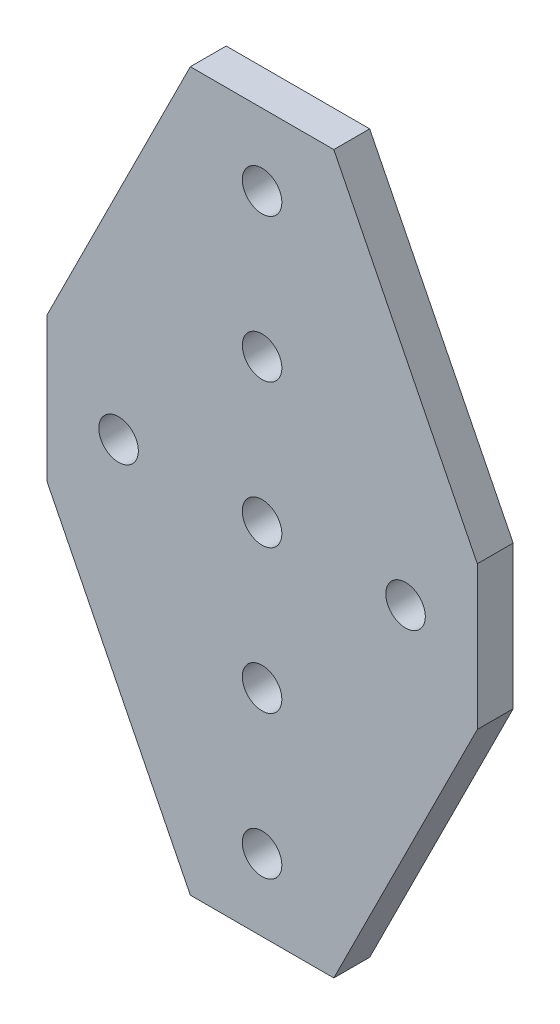
ISO-10303-21;
HEADER;
FILE_DESCRIPTION(('STEP AP214'),'2;1');
FILE_NAME('part.step','',(''),(''),'','','');
FILE_SCHEMA(('AUTOMOTIVE_DESIGN { 1 0 10303 214 1 1 1 1 }'));
ENDSEC;
DATA;
#1=APPLICATION_CONTEXT('core data for automotive mechanical design processes');
#2=APPLICATION_PROTOCOL_DEFINITION('international standard','automotive_design',2000,#1);
#3=PRODUCT_CONTEXT('',#1,'mechanical');
#4=PRODUCT('Part','Part','',(#3));
#5=PRODUCT_RELATED_PRODUCT_CATEGORY('part','',(#4));
#6=PRODUCT_DEFINITION_FORMATION('','',#4);
#7=PRODUCT_DEFINITION_CONTEXT('part definition',#1,'design');
#8=PRODUCT_DEFINITION('design','',#6,#7);
#9=PRODUCT_DEFINITION_SHAPE('','',#8);
#10=(LENGTH_UNIT() NAMED_UNIT(*) SI_UNIT(.MILLI.,.METRE.));
#11=(NAMED_UNIT(*) PLANE_ANGLE_UNIT() SI_UNIT($,.RADIAN.));
#12=(NAMED_UNIT(*) SI_UNIT($,.STERADIAN.) SOLID_ANGLE_UNIT());
#13=UNCERTAINTY_MEASURE_WITH_UNIT(LENGTH_MEASURE(1.E-05),#10,'distance_accuracy_value','');
#14=(GEOMETRIC_REPRESENTATION_CONTEXT(3) GLOBAL_UNCERTAINTY_ASSIGNED_CONTEXT((#13)) GLOBAL_UNIT_ASSIGNED_CONTEXT((#10,
#11,#12)) REPRESENTATION_CONTEXT('',''));
#15=CARTESIAN_POINT('',(0.,0.,0.));
#16=DIRECTION('',(0.,0.,1.));
#17=DIRECTION('',(1.,0.,0.));
#18=AXIS2_PLACEMENT_3D('',#15,#16,#17);
#19=CARTESIAN_POINT('',(0.,0.,6.35));
#20=DIRECTION('',(0.894427190999916,0.447213595499958,0.));
#21=DIRECTION('',(-0.447213595499958,0.894427190999916,0.));
#22=AXIS2_PLACEMENT_3D('',#19,#20,#21);
#23=PLANE('',#22);
#24=DIRECTION('',(0.447213595499958,-0.894427190999916,0.));
#25=VECTOR('',#24,1.);
#26=CARTESIAN_POINT('',(0.,0.,0.));
#27=LINE('',#26,#25);
#28=CARTESIAN_POINT('',(-25.4,50.8,0.));
#29=VERTEX_POINT('',#28);
#30=CARTESIAN_POINT('',(0.,0.,0.));
#31=VERTEX_POINT('',#30);
#32=EDGE_CURVE('E132',#29,#31,#27,.T.);
#33=ORIENTED_EDGE('',*,*,#32,.T.);
#34=DIRECTION('',(0.,0.,-1.));
#35=VECTOR('',#34,1.);
#36=CARTESIAN_POINT('',(0.,0.,6.35));
#37=LINE('',#36,#35);
#38=CARTESIAN_POINT('',(0.,0.,6.35));
#39=VERTEX_POINT('',#38);
#40=EDGE_CURVE('E11',#39,#31,#37,.T.);
#41=ORIENTED_EDGE('',*,*,#40,.F.);
#42=DIRECTION('',(0.447213595499958,-0.894427190999916,0.));
#43=VECTOR('',#42,1.);
#44=CARTESIAN_POINT('',(0.,0.,6.35));
#45=LINE('',#44,#43);
#46=CARTESIAN_POINT('',(-25.4,50.8,6.35));
#47=VERTEX_POINT('',#46);
#48=EDGE_CURVE('E147',#47,#39,#45,.T.);
#49=ORIENTED_EDGE('',*,*,#48,.F.);
#50=DIRECTION('',(0.,0.,-1.));
#51=VECTOR('',#50,1.);
#52=CARTESIAN_POINT('',(-25.4,50.8,6.35));
#53=LINE('',#52,#51);
#54=EDGE_CURVE('E128',#47,#29,#53,.T.);
#55=ORIENTED_EDGE('',*,*,#54,.T.);
#56=EDGE_LOOP('',(#33,#41,#49,#55));
#57=FACE_BOUND('',#56,.T.);
#58=ADVANCED_FACE('F36',(#57),#23,.F.);
#59=CARTESIAN_POINT('',(25.4,0.,6.35));
#60=DIRECTION('',(0.,1.,0.));
#61=DIRECTION('',(-1.,0.,0.));
#62=AXIS2_PLACEMENT_3D('',#59,#60,#61);
#63=PLANE('',#62);
#64=DIRECTION('',(1.,0.,0.));
#65=VECTOR('',#64,1.);
#66=CARTESIAN_POINT('',(25.4,0.,0.));
#67=LINE('',#66,#65);
#68=CARTESIAN_POINT('',(25.4,0.,0.));
#69=VERTEX_POINT('',#68);
#70=EDGE_CURVE('E135',#31,#69,#67,.T.);
#71=ORIENTED_EDGE('',*,*,#70,.T.);
#72=DIRECTION('',(0.,0.,-1.));
#73=VECTOR('',#72,1.);
#74=CARTESIAN_POINT('',(25.4,0.,6.35));
#75=LINE('',#74,#73);
#76=CARTESIAN_POINT('',(25.4,0.,6.35));
#77=VERTEX_POINT('',#76);
#78=EDGE_CURVE('E44',#77,#69,#75,.T.);
#79=ORIENTED_EDGE('',*,*,#78,.F.);
#80=DIRECTION('',(1.,0.,0.));
#81=VECTOR('',#80,1.);
#82=CARTESIAN_POINT('',(25.4,0.,6.35));
#83=LINE('',#82,#81);
#84=EDGE_CURVE('E95',#39,#77,#83,.T.);
#85=ORIENTED_EDGE('',*,*,#84,.F.);
#86=ORIENTED_EDGE('',*,*,#40,.T.);
#87=EDGE_LOOP('',(#71,#79,#85,#86));
#88=FACE_BOUND('',#87,.T.);
#89=ADVANCED_FACE('F250',(#88),#63,.F.);
#90=CARTESIAN_POINT('',(50.8,50.8,6.35));
#91=DIRECTION('',(-0.894427190999916,0.447213595499958,0.));
#92=DIRECTION('',(-0.447213595499958,-0.894427190999916,0.));
#93=AXIS2_PLACEMENT_3D('',#90,#91,#92);
#94=PLANE('',#93);
#95=DIRECTION('',(0.447213595499958,0.894427190999916,0.));
#96=VECTOR('',#95,1.);
#97=CARTESIAN_POINT('',(50.8,50.8,0.));
#98=LINE('',#97,#96);
#99=CARTESIAN_POINT('',(50.8,50.8,0.));
#100=VERTEX_POINT('',#99);
#101=EDGE_CURVE('E138',#69,#100,#98,.T.);
#102=ORIENTED_EDGE('',*,*,#101,.T.);
#103=DIRECTION('',(0.,0.,-1.));
#104=VECTOR('',#103,1.);
#105=CARTESIAN_POINT('',(50.8,50.8,6.35));
#106=LINE('',#105,#104);
#107=CARTESIAN_POINT('',(50.8,50.8,6.35));
#108=VERTEX_POINT('',#107);
#109=EDGE_CURVE('E154',#108,#100,#106,.T.);
#110=ORIENTED_EDGE('',*,*,#109,.F.);
#111=DIRECTION('',(0.447213595499958,0.894427190999916,0.));
#112=VECTOR('',#111,1.);
#113=CARTESIAN_POINT('',(50.8,50.8,6.35));
#114=LINE('',#113,#112);
#115=EDGE_CURVE('E162',#77,#108,#114,.T.);
#116=ORIENTED_EDGE('',*,*,#115,.F.);
#117=ORIENTED_EDGE('',*,*,#78,.T.);
#118=EDGE_LOOP('',(#102,#110,#116,#117));
#119=FACE_BOUND('',#118,.T.);
#120=ADVANCED_FACE('F160',(#119),#94,.F.);
#121=CARTESIAN_POINT('',(50.8,76.2,6.35));
#122=DIRECTION('',(-1.,0.,0.));
#123=DIRECTION('',(0.,-1.,0.));
#124=AXIS2_PLACEMENT_3D('',#121,#122,#123);
#125=PLANE('',#124);
#126=DIRECTION('',(0.,1.,0.));
#127=VECTOR('',#126,1.);
#128=CARTESIAN_POINT('',(50.8,76.2,0.));
#129=LINE('',#128,#127);
#130=CARTESIAN_POINT('',(50.8,76.2,0.));
#131=VERTEX_POINT('',#130);
#132=EDGE_CURVE('E140',#100,#131,#129,.T.);
#133=ORIENTED_EDGE('',*,*,#132,.T.);
#134=DIRECTION('',(0.,0.,-1.));
#135=VECTOR('',#134,1.);
#136=CARTESIAN_POINT('',(50.8,76.2,6.35));
#137=LINE('',#136,#135);
#138=CARTESIAN_POINT('',(50.8,76.2,6.35));
#139=VERTEX_POINT('',#138);
#140=EDGE_CURVE('E151',#139,#131,#137,.T.);
#141=ORIENTED_EDGE('',*,*,#140,.F.);
#142=DIRECTION('',(0.,1.,0.));
#143=VECTOR('',#142,1.);
#144=CARTESIAN_POINT('',(50.8,76.2,6.35));
#145=LINE('',#144,#143);
#146=EDGE_CURVE('E174',#108,#139,#145,.T.);
#147=ORIENTED_EDGE('',*,*,#146,.F.);
#148=ORIENTED_EDGE('',*,*,#109,.T.);
#149=EDGE_LOOP('',(#133,#141,#147,#148));
#150=FACE_BOUND('',#149,.T.);
#151=ADVANCED_FACE('F170',(#150),#125,.F.);
#152=CARTESIAN_POINT('',(25.4,127.,6.35));
#153=DIRECTION('',(-0.894427190999916,-0.447213595499958,0.));
#154=DIRECTION('',(0.447213595499958,-0.894427190999916,0.));
#155=AXIS2_PLACEMENT_3D('',#152,#153,#154);
#156=PLANE('',#155);
#157=DIRECTION('',(-0.447213595499958,0.894427190999916,0.));
#158=VECTOR('',#157,1.);
#159=CARTESIAN_POINT('',(25.4,127.,0.));
#160=LINE('',#159,#158);
#161=CARTESIAN_POINT('',(25.4,127.,0.));
#162=VERTEX_POINT('',#161);
#163=EDGE_CURVE('E142',#131,#162,#160,.T.);
#164=ORIENTED_EDGE('',*,*,#163,.T.);
#165=DIRECTION('',(0.,0.,-1.));
#166=VECTOR('',#165,1.);
#167=CARTESIAN_POINT('',(25.4,127.,6.35));
#168=LINE('',#167,#166);
#169=CARTESIAN_POINT('',(25.4,127.,6.35));
#170=VERTEX_POINT('',#169);
#171=EDGE_CURVE('E123',#170,#162,#168,.T.);
#172=ORIENTED_EDGE('',*,*,#171,.F.);
#173=DIRECTION('',(-0.447213595499958,0.894427190999916,0.));
#174=VECTOR('',#173,1.);
#175=CARTESIAN_POINT('',(25.4,127.,6.35));
#176=LINE('',#175,#174);
#177=EDGE_CURVE('E114',#139,#170,#176,.T.);
#178=ORIENTED_EDGE('',*,*,#177,.F.);
#179=ORIENTED_EDGE('',*,*,#140,.T.);
#180=EDGE_LOOP('',(#164,#172,#178,#179));
#181=FACE_BOUND('',#180,.T.);
#182=ADVANCED_FACE('F173',(#181),#156,.F.);
#183=CARTESIAN_POINT('',(0.,127.,6.35));
#184=DIRECTION('',(0.,-1.,0.));
#185=DIRECTION('',(0.,0.,-1.));
#186=AXIS2_PLACEMENT_3D('',#183,#184,#185);
#187=PLANE('',#186);
#188=DIRECTION('',(-1.,0.,0.));
#189=VECTOR('',#188,1.);
#190=CARTESIAN_POINT('',(0.,127.,0.));
#191=LINE('',#190,#189);
#192=CARTESIAN_POINT('',(0.,127.,0.));
#193=VERTEX_POINT('',#192);
#194=EDGE_CURVE('E122',#162,#193,#191,.T.);
#195=ORIENTED_EDGE('',*,*,#194,.T.);
#196=DIRECTION('',(0.,0.,-1.));
#197=VECTOR('',#196,1.);
#198=CARTESIAN_POINT('',(0.,127.,6.35));
#199=LINE('',#198,#197);
#200=CARTESIAN_POINT('',(0.,127.,6.35));
#201=VERTEX_POINT('',#200);
#202=EDGE_CURVE('E119',#201,#193,#199,.T.);
#203=ORIENTED_EDGE('',*,*,#202,.F.);
#204=DIRECTION('',(-1.,0.,0.));
#205=VECTOR('',#204,1.);
#206=CARTESIAN_POINT('',(0.,127.,6.35));
#207=LINE('',#206,#205);
#208=EDGE_CURVE('E108',#170,#201,#207,.T.);
#209=ORIENTED_EDGE('',*,*,#208,.F.);
#210=ORIENTED_EDGE('',*,*,#171,.T.);
#211=EDGE_LOOP('',(#195,#203,#209,#210));
#212=FACE_BOUND('',#211,.T.);
#213=ADVANCED_FACE('F120',(#212),#187,.F.);
#214=CARTESIAN_POINT('',(-25.4,76.2,6.35));
#215=DIRECTION('',(0.894427190999916,-0.447213595499958,0.));
#216=DIRECTION('',(0.447213595499958,0.894427190999916,0.));
#217=AXIS2_PLACEMENT_3D('',#214,#215,#216);
#218=PLANE('',#217);
#219=DIRECTION('',(-0.447213595499958,-0.894427190999916,0.));
#220=VECTOR('',#219,1.);
#221=CARTESIAN_POINT('',(-25.4,76.2,0.));
#222=LINE('',#221,#220);
#223=CARTESIAN_POINT('',(-25.4,76.2,0.));
#224=VERTEX_POINT('',#223);
#225=EDGE_CURVE('E81',#193,#224,#222,.T.);
#226=ORIENTED_EDGE('',*,*,#225,.T.);
#227=DIRECTION('',(0.,0.,-1.));
#228=VECTOR('',#227,1.);
#229=CARTESIAN_POINT('',(-25.4,76.2,6.35));
#230=LINE('',#229,#228);
#231=CARTESIAN_POINT('',(-25.4,76.2,6.35));
#232=VERTEX_POINT('',#231);
#233=EDGE_CURVE('E124',#232,#224,#230,.T.);
#234=ORIENTED_EDGE('',*,*,#233,.F.);
#235=DIRECTION('',(-0.447213595499958,-0.894427190999916,0.));
#236=VECTOR('',#235,1.);
#237=CARTESIAN_POINT('',(-25.4,76.2,6.35));
#238=LINE('',#237,#236);
#239=EDGE_CURVE('E112',#201,#232,#238,.T.);
#240=ORIENTED_EDGE('',*,*,#239,.F.);
#241=ORIENTED_EDGE('',*,*,#202,.T.);
#242=EDGE_LOOP('',(#226,#234,#240,#241));
#243=FACE_BOUND('',#242,.T.);
#244=ADVANCED_FACE('F126',(#243),#218,.F.);
#245=CARTESIAN_POINT('',(-25.4,50.8,6.35));
#246=DIRECTION('',(1.,0.,0.));
#247=DIRECTION('',(0.,0.,-1.));
#248=AXIS2_PLACEMENT_3D('',#245,#246,#247);
#249=PLANE('',#248);
#250=DIRECTION('',(0.,-1.,0.));
#251=VECTOR('',#250,1.);
#252=CARTESIAN_POINT('',(-25.4,50.8,0.));
#253=LINE('',#252,#251);
#254=EDGE_CURVE('E87',#224,#29,#253,.T.);
#255=ORIENTED_EDGE('',*,*,#254,.T.);
#256=ORIENTED_EDGE('',*,*,#54,.F.);
#257=DIRECTION('',(0.,-1.,0.));
#258=VECTOR('',#257,1.);
#259=CARTESIAN_POINT('',(-25.4,50.8,6.35));
#260=LINE('',#259,#258);
#261=EDGE_CURVE('E52',#232,#47,#260,.T.);
#262=ORIENTED_EDGE('',*,*,#261,.F.);
#263=ORIENTED_EDGE('',*,*,#233,.T.);
#264=EDGE_LOOP('',(#255,#256,#262,#263));
#265=FACE_BOUND('',#264,.T.);
#266=ADVANCED_FACE('F234',(#265),#249,.F.);
#267=CARTESIAN_POINT('',(0.,0.,6.35));
#268=DIRECTION('',(0.,0.,-1.));
#269=DIRECTION('',(-1.,0.,0.));
#270=AXIS2_PLACEMENT_3D('',#267,#268,#269);
#271=PLANE('',#270);
#272=CARTESIAN_POINT('',(12.7000000000003,88.9,6.35));
#273=DIRECTION('',(0.,0.,1.));
#274=DIRECTION('',(-1.,0.,0.));
#275=AXIS2_PLACEMENT_3D('',#272,#273,#274);
#276=CIRCLE('',#275,3.5);
#277=CARTESIAN_POINT('',(9.20000000000027,88.9,6.35));
#278=VERTEX_POINT('',#277);
#279=EDGE_CURVE('E186',#278,#278,#276,.T.);
#280=ORIENTED_EDGE('',*,*,#279,.F.);
#281=EDGE_LOOP('',(#280));
#282=FACE_BOUND('',#281,.T.);
#283=CARTESIAN_POINT('',(12.7000000000005,114.3,6.35));
#284=DIRECTION('',(0.,0.,1.));
#285=DIRECTION('',(-1.,0.,0.));
#286=AXIS2_PLACEMENT_3D('',#283,#284,#285);
#287=CIRCLE('',#286,3.5);
#288=CARTESIAN_POINT('',(9.20000000000053,114.3,6.35));
#289=VERTEX_POINT('',#288);
#290=EDGE_CURVE('E192',#289,#289,#287,.T.);
#291=ORIENTED_EDGE('',*,*,#290,.F.);
#292=EDGE_LOOP('',(#291));
#293=FACE_BOUND('',#292,.T.);
#294=CARTESIAN_POINT('',(12.7000000000005,12.7,6.35));
#295=DIRECTION('',(0.,0.,1.));
#296=DIRECTION('',(1.,0.,0.));
#297=AXIS2_PLACEMENT_3D('',#294,#295,#296);
#298=CIRCLE('',#297,3.5);
#299=CARTESIAN_POINT('',(16.2000000000005,12.7,6.35));
#300=VERTEX_POINT('',#299);
#301=EDGE_CURVE('E198',#300,#300,#298,.T.);
#302=ORIENTED_EDGE('',*,*,#301,.F.);
#303=EDGE_LOOP('',(#302));
#304=FACE_BOUND('',#303,.T.);
#305=CARTESIAN_POINT('',(12.7000000000003,38.1,6.35));
#306=DIRECTION('',(0.,0.,1.));
#307=DIRECTION('',(1.,0.,0.));
#308=AXIS2_PLACEMENT_3D('',#305,#306,#307);
#309=CIRCLE('',#308,3.5);
#310=CARTESIAN_POINT('',(16.2000000000003,38.1,6.35));
#311=VERTEX_POINT('',#310);
#312=EDGE_CURVE('E204',#311,#311,#309,.T.);
#313=ORIENTED_EDGE('',*,*,#312,.F.);
#314=EDGE_LOOP('',(#313));
#315=FACE_BOUND('',#314,.T.);
#316=CARTESIAN_POINT('',(-12.7,63.5000000000004,6.35));
#317=DIRECTION('',(0.,0.,1.));
#318=DIRECTION('',(-1.,0.,0.));
#319=AXIS2_PLACEMENT_3D('',#316,#317,#318);
#320=CIRCLE('',#319,3.5);
#321=CARTESIAN_POINT('',(-16.2,63.5000000000004,6.35));
#322=VERTEX_POINT('',#321);
#323=EDGE_CURVE('E210',#322,#322,#320,.T.);
#324=ORIENTED_EDGE('',*,*,#323,.F.);
#325=EDGE_LOOP('',(#324));
#326=FACE_BOUND('',#325,.T.);
#327=CARTESIAN_POINT('',(38.1,63.5000000000004,6.35));
#328=DIRECTION('',(0.,0.,1.));
#329=DIRECTION('',(1.,0.,0.));
#330=AXIS2_PLACEMENT_3D('',#327,#328,#329);
#331=CIRCLE('',#330,3.5);
#332=CARTESIAN_POINT('',(41.6,63.5000000000004,6.35));
#333=VERTEX_POINT('',#332);
#334=EDGE_CURVE('E216',#333,#333,#331,.T.);
#335=ORIENTED_EDGE('',*,*,#334,.F.);
#336=EDGE_LOOP('',(#335));
#337=FACE_BOUND('',#336,.T.);
#338=CARTESIAN_POINT('',(12.7,63.5,6.35));
#339=DIRECTION('',(0.,0.,1.));
#340=DIRECTION('',(1.,0.,0.));
#341=AXIS2_PLACEMENT_3D('',#338,#339,#340);
#342=CIRCLE('',#341,3.5);
#343=CARTESIAN_POINT('',(16.2,63.5,6.35));
#344=VERTEX_POINT('',#343);
#345=EDGE_CURVE('E180',#344,#344,#342,.T.);
#346=ORIENTED_EDGE('',*,*,#345,.F.);
#347=EDGE_LOOP('',(#346));
#348=FACE_BOUND('',#347,.T.);
#349=ORIENTED_EDGE('',*,*,#48,.T.);
#350=ORIENTED_EDGE('',*,*,#84,.T.);
#351=ORIENTED_EDGE('',*,*,#115,.T.);
#352=ORIENTED_EDGE('',*,*,#146,.T.);
#353=ORIENTED_EDGE('',*,*,#177,.T.);
#354=ORIENTED_EDGE('',*,*,#208,.T.);
#355=ORIENTED_EDGE('',*,*,#239,.T.);
#356=ORIENTED_EDGE('',*,*,#261,.T.);
#357=EDGE_LOOP('',(#349,#350,#351,#352,#353,#354,#355,#356));
#358=FACE_BOUND('',#357,.T.);
#359=ADVANCED_FACE('F110',(#282,#293,#304,#315,#326,#337,#348,#358),#271,.F.);
#360=CARTESIAN_POINT('',(0.,0.,0.));
#361=DIRECTION('',(0.,0.,-1.));
#362=DIRECTION('',(-1.,0.,0.));
#363=AXIS2_PLACEMENT_3D('',#360,#361,#362);
#364=PLANE('',#363);
#365=CARTESIAN_POINT('',(12.7000000000003,88.9,0.));
#366=DIRECTION('',(0.,0.,1.));
#367=DIRECTION('',(-1.,0.,0.));
#368=AXIS2_PLACEMENT_3D('',#365,#366,#367);
#369=CIRCLE('',#368,3.5);
#370=CARTESIAN_POINT('',(9.20000000000027,88.9,0.));
#371=VERTEX_POINT('',#370);
#372=EDGE_CURVE('E189',#371,#371,#369,.T.);
#373=ORIENTED_EDGE('',*,*,#372,.T.);
#374=EDGE_LOOP('',(#373));
#375=FACE_BOUND('',#374,.T.);
#376=CARTESIAN_POINT('',(12.7000000000005,114.3,0.));
#377=DIRECTION('',(0.,0.,1.));
#378=DIRECTION('',(-1.,0.,0.));
#379=AXIS2_PLACEMENT_3D('',#376,#377,#378);
#380=CIRCLE('',#379,3.5);
#381=CARTESIAN_POINT('',(9.20000000000053,114.3,0.));
#382=VERTEX_POINT('',#381);
#383=EDGE_CURVE('E195',#382,#382,#380,.T.);
#384=ORIENTED_EDGE('',*,*,#383,.T.);
#385=EDGE_LOOP('',(#384));
#386=FACE_BOUND('',#385,.T.);
#387=CARTESIAN_POINT('',(12.7000000000005,12.7,0.));
#388=DIRECTION('',(0.,0.,1.));
#389=DIRECTION('',(1.,0.,0.));
#390=AXIS2_PLACEMENT_3D('',#387,#388,#389);
#391=CIRCLE('',#390,3.5);
#392=CARTESIAN_POINT('',(16.2000000000005,12.7,0.));
#393=VERTEX_POINT('',#392);
#394=EDGE_CURVE('E201',#393,#393,#391,.T.);
#395=ORIENTED_EDGE('',*,*,#394,.T.);
#396=EDGE_LOOP('',(#395));
#397=FACE_BOUND('',#396,.T.);
#398=CARTESIAN_POINT('',(12.7000000000003,38.1,0.));
#399=DIRECTION('',(0.,0.,1.));
#400=DIRECTION('',(1.,0.,0.));
#401=AXIS2_PLACEMENT_3D('',#398,#399,#400);
#402=CIRCLE('',#401,3.5);
#403=CARTESIAN_POINT('',(16.2000000000003,38.1,0.));
#404=VERTEX_POINT('',#403);
#405=EDGE_CURVE('E207',#404,#404,#402,.T.);
#406=ORIENTED_EDGE('',*,*,#405,.T.);
#407=EDGE_LOOP('',(#406));
#408=FACE_BOUND('',#407,.T.);
#409=CARTESIAN_POINT('',(-12.7,63.5000000000004,0.));
#410=DIRECTION('',(0.,0.,1.));
#411=DIRECTION('',(-1.,0.,0.));
#412=AXIS2_PLACEMENT_3D('',#409,#410,#411);
#413=CIRCLE('',#412,3.5);
#414=CARTESIAN_POINT('',(-16.2,63.5000000000004,0.));
#415=VERTEX_POINT('',#414);
#416=EDGE_CURVE('E213',#415,#415,#413,.T.);
#417=ORIENTED_EDGE('',*,*,#416,.T.);
#418=EDGE_LOOP('',(#417));
#419=FACE_BOUND('',#418,.T.);
#420=CARTESIAN_POINT('',(38.1,63.5000000000004,0.));
#421=DIRECTION('',(0.,0.,1.));
#422=DIRECTION('',(1.,0.,0.));
#423=AXIS2_PLACEMENT_3D('',#420,#421,#422);
#424=CIRCLE('',#423,3.5);
#425=CARTESIAN_POINT('',(41.6,63.5000000000004,0.));
#426=VERTEX_POINT('',#425);
#427=EDGE_CURVE('E183',#426,#426,#424,.T.);
#428=ORIENTED_EDGE('',*,*,#427,.T.);
#429=EDGE_LOOP('',(#428));
#430=FACE_BOUND('',#429,.T.);
#431=CARTESIAN_POINT('',(12.7,63.5,0.));
#432=DIRECTION('',(0.,0.,1.));
#433=DIRECTION('',(1.,0.,0.));
#434=AXIS2_PLACEMENT_3D('',#431,#432,#433);
#435=CIRCLE('',#434,3.5);
#436=CARTESIAN_POINT('',(16.2,63.5,0.));
#437=VERTEX_POINT('',#436);
#438=EDGE_CURVE('E136',#437,#437,#435,.T.);
#439=ORIENTED_EDGE('',*,*,#438,.T.);
#440=EDGE_LOOP('',(#439));
#441=FACE_BOUND('',#440,.T.);
#442=ORIENTED_EDGE('',*,*,#32,.F.);
#443=ORIENTED_EDGE('',*,*,#254,.F.);
#444=ORIENTED_EDGE('',*,*,#225,.F.);
#445=ORIENTED_EDGE('',*,*,#194,.F.);
#446=ORIENTED_EDGE('',*,*,#163,.F.);
#447=ORIENTED_EDGE('',*,*,#132,.F.);
#448=ORIENTED_EDGE('',*,*,#101,.F.);
#449=ORIENTED_EDGE('',*,*,#70,.F.);
#450=EDGE_LOOP('',(#442,#443,#444,#445,#446,#447,#448,#449));
#451=FACE_BOUND('',#450,.T.);
#452=ADVANCED_FACE('F166',(#375,#386,#397,#408,#419,#430,#441,#451),#364,.T.);
#453=CARTESIAN_POINT('',(12.7,63.5,0.));
#454=DIRECTION('',(0.,0.,1.));
#455=DIRECTION('',(1.,0.,0.));
#456=AXIS2_PLACEMENT_3D('',#453,#454,#455);
#457=CYLINDRICAL_SURFACE('',#456,3.5);
#458=ORIENTED_EDGE('',*,*,#438,.F.);
#459=EDGE_LOOP('',(#458));
#460=FACE_BOUND('',#459,.T.);
#461=ORIENTED_EDGE('',*,*,#345,.T.);
#462=EDGE_LOOP('',(#461));
#463=FACE_BOUND('',#462,.T.);
#464=ADVANCED_FACE('F228',(#460,#463),#457,.F.);
#465=CARTESIAN_POINT('',(38.1,63.5000000000004,0.));
#466=DIRECTION('',(0.,0.,1.));
#467=DIRECTION('',(1.,0.,0.));
#468=AXIS2_PLACEMENT_3D('',#465,#466,#467);
#469=CYLINDRICAL_SURFACE('',#468,3.5);
#470=ORIENTED_EDGE('',*,*,#427,.F.);
#471=EDGE_LOOP('',(#470));
#472=FACE_BOUND('',#471,.T.);
#473=ORIENTED_EDGE('',*,*,#334,.T.);
#474=EDGE_LOOP('',(#473));
#475=FACE_BOUND('',#474,.T.);
#476=ADVANCED_FACE('F224',(#472,#475),#469,.F.);
#477=CARTESIAN_POINT('',(-12.7,63.5000000000004,0.));
#478=DIRECTION('',(0.,0.,1.));
#479=DIRECTION('',(1.,0.,0.));
#480=AXIS2_PLACEMENT_3D('',#477,#478,#479);
#481=CYLINDRICAL_SURFACE('',#480,3.5);
#482=ORIENTED_EDGE('',*,*,#416,.F.);
#483=EDGE_LOOP('',(#482));
#484=FACE_BOUND('',#483,.T.);
#485=ORIENTED_EDGE('',*,*,#323,.T.);
#486=EDGE_LOOP('',(#485));
#487=FACE_BOUND('',#486,.T.);
#488=ADVANCED_FACE('F227',(#484,#487),#481,.F.);
#489=CARTESIAN_POINT('',(12.7000000000003,38.1,0.));
#490=DIRECTION('',(0.,0.,1.));
#491=DIRECTION('',(1.,0.,0.));
#492=AXIS2_PLACEMENT_3D('',#489,#490,#491);
#493=CYLINDRICAL_SURFACE('',#492,3.5);
#494=ORIENTED_EDGE('',*,*,#405,.F.);
#495=EDGE_LOOP('',(#494));
#496=FACE_BOUND('',#495,.T.);
#497=ORIENTED_EDGE('',*,*,#312,.T.);
#498=EDGE_LOOP('',(#497));
#499=FACE_BOUND('',#498,.T.);
#500=ADVANCED_FACE('F326',(#496,#499),#493,.F.);
#501=CARTESIAN_POINT('',(12.7000000000005,12.7,0.));
#502=DIRECTION('',(0.,0.,1.));
#503=DIRECTION('',(1.,0.,0.));
#504=AXIS2_PLACEMENT_3D('',#501,#502,#503);
#505=CYLINDRICAL_SURFACE('',#504,3.5);
#506=ORIENTED_EDGE('',*,*,#394,.F.);
#507=EDGE_LOOP('',(#506));
#508=FACE_BOUND('',#507,.T.);
#509=ORIENTED_EDGE('',*,*,#301,.T.);
#510=EDGE_LOOP('',(#509));
#511=FACE_BOUND('',#510,.T.);
#512=ADVANCED_FACE('F336',(#508,#511),#505,.F.);
#513=CARTESIAN_POINT('',(12.7000000000005,114.3,0.));
#514=DIRECTION('',(0.,0.,1.));
#515=DIRECTION('',(1.,0.,0.));
#516=AXIS2_PLACEMENT_3D('',#513,#514,#515);
#517=CYLINDRICAL_SURFACE('',#516,3.5);
#518=ORIENTED_EDGE('',*,*,#383,.F.);
#519=EDGE_LOOP('',(#518));
#520=FACE_BOUND('',#519,.T.);
#521=ORIENTED_EDGE('',*,*,#290,.T.);
#522=EDGE_LOOP('',(#521));
#523=FACE_BOUND('',#522,.T.);
#524=ADVANCED_FACE('F346',(#520,#523),#517,.F.);
#525=CARTESIAN_POINT('',(12.7000000000003,88.9,0.));
#526=DIRECTION('',(0.,0.,1.));
#527=DIRECTION('',(1.,0.,0.));
#528=AXIS2_PLACEMENT_3D('',#525,#526,#527);
#529=CYLINDRICAL_SURFACE('',#528,3.5);
#530=ORIENTED_EDGE('',*,*,#372,.F.);
#531=EDGE_LOOP('',(#530));
#532=FACE_BOUND('',#531,.T.);
#533=ORIENTED_EDGE('',*,*,#279,.T.);
#534=EDGE_LOOP('',(#533));
#535=FACE_BOUND('',#534,.T.);
#536=ADVANCED_FACE('F356',(#532,#535),#529,.F.);
#537=CLOSED_SHELL('',(#58,#89,#120,#151,#182,#213,#244,#266,#359,#452,#464,#476,#488,#500,#512,
#524,#536));
#538=MANIFOLD_SOLID_BREP('B2',#537);
#539=ADVANCED_BREP_SHAPE_REPRESENTATION('',(#18,#538),#14);
#540=SHAPE_DEFINITION_REPRESENTATION(#9,#539);
ENDSEC;
END-ISO-10303-21;
